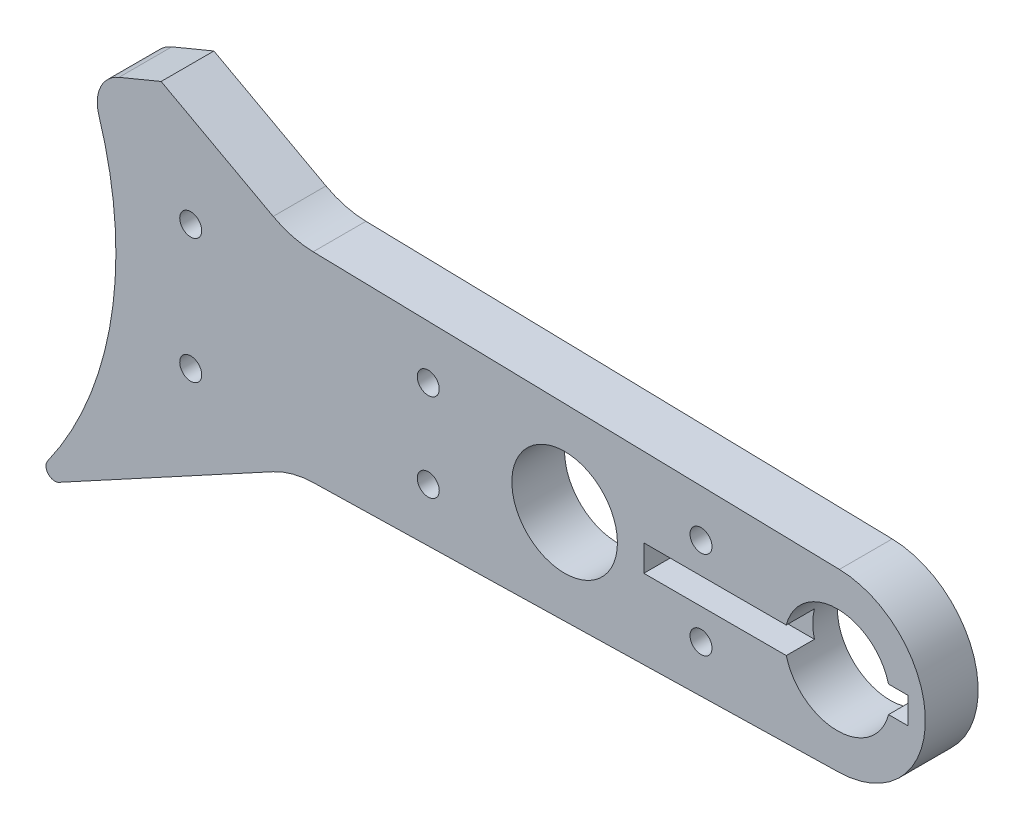
ISO-10303-21;
HEADER;
FILE_DESCRIPTION(('STEP AP214'),'2;1');
FILE_NAME('part.step','',(''),(''),'','','');
FILE_SCHEMA(('AUTOMOTIVE_DESIGN { 1 0 10303 214 1 1 1 1 }'));
ENDSEC;
DATA;
#1=APPLICATION_CONTEXT('core data for automotive mechanical design processes');
#2=APPLICATION_PROTOCOL_DEFINITION('international standard','automotive_design',2000,#1);
#3=PRODUCT_CONTEXT('',#1,'mechanical');
#4=PRODUCT('Part','Part','',(#3));
#5=PRODUCT_RELATED_PRODUCT_CATEGORY('part','',(#4));
#6=PRODUCT_DEFINITION_FORMATION('','',#4);
#7=PRODUCT_DEFINITION_CONTEXT('part definition',#1,'design');
#8=PRODUCT_DEFINITION('design','',#6,#7);
#9=PRODUCT_DEFINITION_SHAPE('','',#8);
#10=(LENGTH_UNIT() NAMED_UNIT(*) SI_UNIT(.MILLI.,.METRE.));
#11=(NAMED_UNIT(*) PLANE_ANGLE_UNIT() SI_UNIT($,.RADIAN.));
#12=(NAMED_UNIT(*) SI_UNIT($,.STERADIAN.) SOLID_ANGLE_UNIT());
#13=UNCERTAINTY_MEASURE_WITH_UNIT(LENGTH_MEASURE(1.E-05),#10,'distance_accuracy_value','');
#14=(GEOMETRIC_REPRESENTATION_CONTEXT(3) GLOBAL_UNCERTAINTY_ASSIGNED_CONTEXT((#13)) GLOBAL_UNIT_ASSIGNED_CONTEXT((#10,
#11,#12)) REPRESENTATION_CONTEXT('',''));
#15=CARTESIAN_POINT('',(0.,0.,0.));
#16=DIRECTION('',(0.,0.,1.));
#17=DIRECTION('',(1.,0.,0.));
#18=AXIS2_PLACEMENT_3D('',#15,#16,#17);
#19=CARTESIAN_POINT('',(62.,0.,3.));
#20=DIRECTION('',(0.,0.,1.));
#21=DIRECTION('',(1.,0.,0.));
#22=AXIS2_PLACEMENT_3D('',#19,#20,#21);
#23=PLANE('',#22);
#24=CARTESIAN_POINT('',(0.,0.,3.));
#25=DIRECTION('',(0.,0.,1.));
#26=DIRECTION('',(1.,0.,0.));
#27=AXIS2_PLACEMENT_3D('',#24,#25,#26);
#28=CIRCLE('',#27,21.);
#29=CARTESIAN_POINT('',(17.1198617164504,-12.161839285635,3.));
#30=VERTEX_POINT('',#29);
#31=CARTESIAN_POINT('',(20.0327066352791,6.30005276683013,3.));
#32=VERTEX_POINT('',#31);
#33=EDGE_CURVE('E241',#30,#32,#28,.T.);
#34=ORIENTED_EDGE('',*,*,#33,.F.);
#35=CARTESIAN_POINT('',(17.527477471604,-12.4514068876739,3.));
#36=DIRECTION('',(0.,0.,1.));
#37=DIRECTION('',(1.,0.,0.));
#38=AXIS2_PLACEMENT_3D('',#35,#36,#37);
#39=CIRCLE('',#38,0.5);
#40=CARTESIAN_POINT('',(17.7660568517338,-12.8908154440049,3.));
#41=VERTEX_POINT('',#40);
#42=EDGE_CURVE('E56',#30,#41,#39,.T.);
#43=ORIENTED_EDGE('',*,*,#42,.T.);
#44=DIRECTION('',(0.878817112661965,0.47715876025961,0.));
#45=VECTOR('',#44,1.);
#46=CARTESIAN_POINT('',(31.,-5.70537058296273,3.));
#47=LINE('',#46,#45);
#48=CARTESIAN_POINT('',(29.9370032673693,-6.28253071764159,3.));
#49=VERTEX_POINT('',#48);
#50=EDGE_CURVE('E405',#41,#49,#47,.T.);
#51=ORIENTED_EDGE('',*,*,#50,.T.);
#52=CARTESIAN_POINT('',(32.3227970686674,-10.6766162809514,3.));
#53=DIRECTION('',(0.,0.,1.));
#54=DIRECTION('',(1.,0.,0.));
#55=AXIS2_PLACEMENT_3D('',#52,#53,#54);
#56=CIRCLE('',#55,5.);
#57=CARTESIAN_POINT('',(32.2092648752598,-5.67790540302897,3.));
#58=VERTEX_POINT('',#57);
#59=EDGE_CURVE('E338',#49,#58,#56,.F.);
#60=ORIENTED_EDGE('',*,*,#59,.T.);
#61=DIRECTION('',(0.999742175584487,0.0227064386815126,0.));
#62=VECTOR('',#61,1.);
#63=CARTESIAN_POINT('',(18.0277563773199,-6.,3.));
#64=LINE('',#63,#62);
#65=CARTESIAN_POINT('',(62.1135321934076,-4.99871087792244,3.));
#66=VERTEX_POINT('',#65);
#67=EDGE_CURVE('E288',#58,#66,#64,.T.);
#68=ORIENTED_EDGE('',*,*,#67,.T.);
#69=CARTESIAN_POINT('',(62.,0.,3.));
#70=DIRECTION('',(0.,0.,1.));
#71=DIRECTION('',(1.,0.,0.));
#72=AXIS2_PLACEMENT_3D('',#69,#70,#71);
#73=CIRCLE('',#72,5.);
#74=CARTESIAN_POINT('',(62.1135321934076,4.99871087792244,3.));
#75=VERTEX_POINT('',#74);
#76=EDGE_CURVE('E281',#66,#75,#73,.T.);
#77=ORIENTED_EDGE('',*,*,#76,.T.);
#78=DIRECTION('',(-0.999742175584487,0.0227064386815126,0.));
#79=VECTOR('',#78,1.);
#80=CARTESIAN_POINT('',(18.0277563773199,6.,3.));
#81=LINE('',#80,#79);
#82=CARTESIAN_POINT('',(32.2092648752598,5.67790540302897,3.));
#83=VERTEX_POINT('',#82);
#84=EDGE_CURVE('E284',#75,#83,#81,.T.);
#85=ORIENTED_EDGE('',*,*,#84,.T.);
#86=CARTESIAN_POINT('',(32.3227970686674,10.6766162809514,3.));
#87=DIRECTION('',(0.,0.,1.));
#88=DIRECTION('',(1.,0.,0.));
#89=AXIS2_PLACEMENT_3D('',#86,#87,#88);
#90=CIRCLE('',#89,5.);
#91=CARTESIAN_POINT('',(29.9370032673693,6.28253071764158,3.));
#92=VERTEX_POINT('',#91);
#93=EDGE_CURVE('E334',#83,#92,#90,.F.);
#94=ORIENTED_EDGE('',*,*,#93,.T.);
#95=DIRECTION('',(-0.878817112661965,0.477158760259609,0.));
#96=VECTOR('',#95,1.);
#97=CARTESIAN_POINT('',(31.,5.70537058296273,3.));
#98=LINE('',#97,#96);
#99=CARTESIAN_POINT('',(23.5697521941608,9.73966597886913,3.));
#100=VERTEX_POINT('',#99);
#101=EDGE_CURVE('E173',#92,#100,#98,.T.);
#102=ORIENTED_EDGE('',*,*,#101,.T.);
#103=DIRECTION('',(0.923879532511286,0.382683432365091,0.));
#104=VECTOR('',#103,1.);
#105=CARTESIAN_POINT('',(22.5,9.29656011166936,3.));
#106=LINE('',#105,#104);
#107=CARTESIAN_POINT('',(21.1752165929565,8.7478168572651,3.));
#108=VERTEX_POINT('',#107);
#109=EDGE_CURVE('E184',#108,#100,#106,.T.);
#110=ORIENTED_EDGE('',*,*,#109,.F.);
#111=CARTESIAN_POINT('',(21.9405834576867,6.90005779224252,3.));
#112=DIRECTION('',(0.,0.,1.));
#113=DIRECTION('',(1.,0.,0.));
#114=AXIS2_PLACEMENT_3D('',#111,#112,#113);
#115=CIRCLE('',#114,2.);
#116=EDGE_CURVE('E322',#108,#32,#115,.T.);
#117=ORIENTED_EDGE('',*,*,#116,.T.);
#118=EDGE_LOOP('',(#34,#43,#51,#60,#68,#77,#85,#94,#102,#110,#117));
#119=FACE_BOUND('',#118,.T.);
#120=DIRECTION('',(-1.,0.,0.));
#121=VECTOR('',#120,1.);
#122=CARTESIAN_POINT('',(51.,0.75,3.));
#123=LINE('',#122,#121);
#124=CARTESIAN_POINT('',(59.0952624903444,0.75,3.));
#125=VERTEX_POINT('',#124);
#126=CARTESIAN_POINT('',(51.,0.75,3.));
#127=VERTEX_POINT('',#126);
#128=EDGE_CURVE('E215',#125,#127,#123,.T.);
#129=ORIENTED_EDGE('',*,*,#128,.F.);
#130=CARTESIAN_POINT('',(62.,0.,3.));
#131=DIRECTION('',(0.,0.,1.));
#132=DIRECTION('',(1.,0.,0.));
#133=AXIS2_PLACEMENT_3D('',#130,#131,#132);
#134=CIRCLE('',#133,3.00000000000001);
#135=CARTESIAN_POINT('',(64.9047375096556,0.75,3.));
#136=VERTEX_POINT('',#135);
#137=EDGE_CURVE('E268',#136,#125,#134,.T.);
#138=ORIENTED_EDGE('',*,*,#137,.F.);
#139=CARTESIAN_POINT('',(66.,0.75,3.));
#140=VERTEX_POINT('',#139);
#141=EDGE_CURVE('E197',#140,#136,#123,.T.);
#142=ORIENTED_EDGE('',*,*,#141,.F.);
#143=DIRECTION('',(0.,1.,0.));
#144=VECTOR('',#143,1.);
#145=CARTESIAN_POINT('',(66.,0.75,3.));
#146=LINE('',#145,#144);
#147=CARTESIAN_POINT('',(66.,-0.75,3.));
#148=VERTEX_POINT('',#147);
#149=EDGE_CURVE('E212',#148,#140,#146,.T.);
#150=ORIENTED_EDGE('',*,*,#149,.F.);
#151=DIRECTION('',(1.,0.,0.));
#152=VECTOR('',#151,1.);
#153=CARTESIAN_POINT('',(51.,-0.75,3.));
#154=LINE('',#153,#152);
#155=CARTESIAN_POINT('',(64.9047375096556,-0.75,3.));
#156=VERTEX_POINT('',#155);
#157=EDGE_CURVE('E209',#156,#148,#154,.T.);
#158=ORIENTED_EDGE('',*,*,#157,.F.);
#159=CARTESIAN_POINT('',(59.0952624903444,-0.75,3.));
#160=VERTEX_POINT('',#159);
#161=EDGE_CURVE('E272',#160,#156,#134,.T.);
#162=ORIENTED_EDGE('',*,*,#161,.F.);
#163=CARTESIAN_POINT('',(51.,-0.75,3.));
#164=VERTEX_POINT('',#163);
#165=EDGE_CURVE('E210',#164,#160,#154,.T.);
#166=ORIENTED_EDGE('',*,*,#165,.F.);
#167=DIRECTION('',(0.,-1.,0.));
#168=VECTOR('',#167,1.);
#169=CARTESIAN_POINT('',(51.,0.75,3.));
#170=LINE('',#169,#168);
#171=EDGE_CURVE('E183',#127,#164,#170,.T.);
#172=ORIENTED_EDGE('',*,*,#171,.F.);
#173=EDGE_LOOP('',(#129,#138,#142,#150,#158,#162,#166,#172));
#174=FACE_BOUND('',#173,.T.);
#175=CARTESIAN_POINT('',(25.25183575291,-3.54891407448168,3.));
#176=DIRECTION('',(0.,0.,-1.));
#177=DIRECTION('',(-1.,0.,0.));
#178=AXIS2_PLACEMENT_3D('',#175,#176,#177);
#179=CIRCLE('',#178,0.624999999999999);
#180=CARTESIAN_POINT('',(24.62683575291,-3.54891407448168,3.));
#181=VERTEX_POINT('',#180);
#182=EDGE_CURVE('E227',#181,#181,#179,.T.);
#183=ORIENTED_EDGE('',*,*,#182,.T.);
#184=EDGE_LOOP('',(#183));
#185=FACE_BOUND('',#184,.T.);
#186=CARTESIAN_POINT('',(25.25183575291,3.54891407448167,3.));
#187=DIRECTION('',(0.,0.,-1.));
#188=DIRECTION('',(-1.,0.,0.));
#189=AXIS2_PLACEMENT_3D('',#186,#187,#188);
#190=CIRCLE('',#189,0.624999999999999);
#191=CARTESIAN_POINT('',(24.62683575291,3.54891407448167,3.));
#192=VERTEX_POINT('',#191);
#193=EDGE_CURVE('E233',#192,#192,#190,.T.);
#194=ORIENTED_EDGE('',*,*,#193,.T.);
#195=EDGE_LOOP('',(#194));
#196=FACE_BOUND('',#195,.T.);
#197=CARTESIAN_POINT('',(38.75,2.5,3.));
#198=DIRECTION('',(0.,0.,1.));
#199=DIRECTION('',(1.,0.,0.));
#200=AXIS2_PLACEMENT_3D('',#197,#198,#199);
#201=CIRCLE('',#200,0.625000000000001);
#202=CARTESIAN_POINT('',(39.375,2.5,3.));
#203=VERTEX_POINT('',#202);
#204=EDGE_CURVE('E243',#203,#203,#201,.T.);
#205=ORIENTED_EDGE('',*,*,#204,.F.);
#206=EDGE_LOOP('',(#205));
#207=FACE_BOUND('',#206,.T.);
#208=CARTESIAN_POINT('',(54.25,-2.5,3.));
#209=DIRECTION('',(0.,0.,1.));
#210=DIRECTION('',(1.,0.,0.));
#211=AXIS2_PLACEMENT_3D('',#208,#209,#210);
#212=CIRCLE('',#211,0.625000000000001);
#213=CARTESIAN_POINT('',(54.875,-2.5,3.));
#214=VERTEX_POINT('',#213);
#215=EDGE_CURVE('E249',#214,#214,#212,.T.);
#216=ORIENTED_EDGE('',*,*,#215,.F.);
#217=EDGE_LOOP('',(#216));
#218=FACE_BOUND('',#217,.T.);
#219=CARTESIAN_POINT('',(38.75,-2.5,3.));
#220=DIRECTION('',(0.,0.,1.));
#221=DIRECTION('',(1.,0.,0.));
#222=AXIS2_PLACEMENT_3D('',#219,#220,#221);
#223=CIRCLE('',#222,0.625000000000001);
#224=CARTESIAN_POINT('',(39.375,-2.5,3.));
#225=VERTEX_POINT('',#224);
#226=EDGE_CURVE('E255',#225,#225,#223,.T.);
#227=ORIENTED_EDGE('',*,*,#226,.F.);
#228=EDGE_LOOP('',(#227));
#229=FACE_BOUND('',#228,.T.);
#230=CARTESIAN_POINT('',(54.25,2.5,3.));
#231=DIRECTION('',(0.,0.,1.));
#232=DIRECTION('',(1.,0.,0.));
#233=AXIS2_PLACEMENT_3D('',#230,#231,#232);
#234=CIRCLE('',#233,0.625000000000001);
#235=CARTESIAN_POINT('',(54.875,2.5,3.));
#236=VERTEX_POINT('',#235);
#237=EDGE_CURVE('E261',#236,#236,#234,.T.);
#238=ORIENTED_EDGE('',*,*,#237,.F.);
#239=EDGE_LOOP('',(#238));
#240=FACE_BOUND('',#239,.T.);
#241=CARTESIAN_POINT('',(46.5,0.,3.));
#242=DIRECTION('',(0.,0.,1.));
#243=DIRECTION('',(1.,0.,0.));
#244=AXIS2_PLACEMENT_3D('',#241,#242,#243);
#245=CIRCLE('',#244,3.);
#246=CARTESIAN_POINT('',(49.5,0.,3.));
#247=VERTEX_POINT('',#246);
#248=EDGE_CURVE('E275',#247,#247,#245,.T.);
#249=ORIENTED_EDGE('',*,*,#248,.F.);
#250=EDGE_LOOP('',(#249));
#251=FACE_BOUND('',#250,.T.);
#252=ADVANCED_FACE('F34',(#119,#174,#185,#196,#207,#218,#229,#240,#251),#23,.T.);
#253=CARTESIAN_POINT('',(62.,0.,0.));
#254=DIRECTION('',(0.,0.,1.));
#255=DIRECTION('',(1.,0.,0.));
#256=AXIS2_PLACEMENT_3D('',#253,#254,#255);
#257=PLANE('',#256);
#258=DIRECTION('',(0.878817112661965,0.47715876025961,0.));
#259=VECTOR('',#258,1.);
#260=CARTESIAN_POINT('',(31.,-5.70537058296273,0.));
#261=LINE('',#260,#259);
#262=CARTESIAN_POINT('',(17.7660568517338,-12.8908154440049,0.));
#263=VERTEX_POINT('',#262);
#264=CARTESIAN_POINT('',(29.9370032673693,-6.28253071764159,0.));
#265=VERTEX_POINT('',#264);
#266=EDGE_CURVE('E356',#263,#265,#261,.T.);
#267=ORIENTED_EDGE('',*,*,#266,.F.);
#268=CARTESIAN_POINT('',(17.527477471604,-12.4514068876739,0.));
#269=DIRECTION('',(0.,0.,1.));
#270=DIRECTION('',(1.,0.,0.));
#271=AXIS2_PLACEMENT_3D('',#268,#269,#270);
#272=CIRCLE('',#271,0.5);
#273=CARTESIAN_POINT('',(17.1198617164504,-12.161839285635,0.));
#274=VERTEX_POINT('',#273);
#275=EDGE_CURVE('E11',#263,#274,#272,.F.);
#276=ORIENTED_EDGE('',*,*,#275,.T.);
#277=CARTESIAN_POINT('',(0.,0.,0.));
#278=DIRECTION('',(0.,0.,-1.));
#279=DIRECTION('',(-1.,0.,0.));
#280=AXIS2_PLACEMENT_3D('',#277,#278,#279);
#281=CIRCLE('',#280,21.);
#282=CARTESIAN_POINT('',(20.0327066352791,6.30005276683013,0.));
#283=VERTEX_POINT('',#282);
#284=EDGE_CURVE('E236',#283,#274,#281,.T.);
#285=ORIENTED_EDGE('',*,*,#284,.F.);
#286=CARTESIAN_POINT('',(21.9405834576867,6.90005779224252,0.));
#287=DIRECTION('',(0.,0.,1.));
#288=DIRECTION('',(1.,0.,0.));
#289=AXIS2_PLACEMENT_3D('',#286,#287,#288);
#290=CIRCLE('',#289,2.);
#291=CARTESIAN_POINT('',(21.1752165929565,8.74781685726509,0.));
#292=VERTEX_POINT('',#291);
#293=EDGE_CURVE('E180',#283,#292,#290,.F.);
#294=ORIENTED_EDGE('',*,*,#293,.T.);
#295=DIRECTION('',(0.923879532511287,0.382683432365091,0.));
#296=VECTOR('',#295,1.);
#297=CARTESIAN_POINT('',(52.9285285800994,21.9004693326039,0.));
#298=LINE('',#297,#296);
#299=CARTESIAN_POINT('',(23.5697521941608,9.73966597886913,0.));
#300=VERTEX_POINT('',#299);
#301=EDGE_CURVE('E176',#292,#300,#298,.T.);
#302=ORIENTED_EDGE('',*,*,#301,.T.);
#303=DIRECTION('',(-0.878817112661965,0.477158760259609,0.));
#304=VECTOR('',#303,1.);
#305=CARTESIAN_POINT('',(31.,5.70537058296273,0.));
#306=LINE('',#305,#304);
#307=CARTESIAN_POINT('',(29.9370032673693,6.28253071764158,0.));
#308=VERTEX_POINT('',#307);
#309=EDGE_CURVE('E163',#308,#300,#306,.T.);
#310=ORIENTED_EDGE('',*,*,#309,.F.);
#311=CARTESIAN_POINT('',(32.3227970686674,10.6766162809514,0.));
#312=DIRECTION('',(0.,0.,1.));
#313=DIRECTION('',(1.,0.,0.));
#314=AXIS2_PLACEMENT_3D('',#311,#312,#313);
#315=CIRCLE('',#314,5.);
#316=CARTESIAN_POINT('',(32.2092648752598,5.67790540302897,0.));
#317=VERTEX_POINT('',#316);
#318=EDGE_CURVE('E336',#308,#317,#315,.T.);
#319=ORIENTED_EDGE('',*,*,#318,.T.);
#320=DIRECTION('',(-0.999742175584487,0.0227064386815126,0.));
#321=VECTOR('',#320,1.);
#322=CARTESIAN_POINT('',(18.0277563773199,6.,0.));
#323=LINE('',#322,#321);
#324=CARTESIAN_POINT('',(62.1135321934076,4.99871087792244,0.));
#325=VERTEX_POINT('',#324);
#326=EDGE_CURVE('E293',#325,#317,#323,.T.);
#327=ORIENTED_EDGE('',*,*,#326,.F.);
#328=CARTESIAN_POINT('',(62.,0.,0.));
#329=DIRECTION('',(0.,0.,1.));
#330=DIRECTION('',(1.,0.,0.));
#331=AXIS2_PLACEMENT_3D('',#328,#329,#330);
#332=CIRCLE('',#331,5.);
#333=CARTESIAN_POINT('',(62.1135321934076,-4.99871087792244,0.));
#334=VERTEX_POINT('',#333);
#335=EDGE_CURVE('E278',#334,#325,#332,.T.);
#336=ORIENTED_EDGE('',*,*,#335,.F.);
#337=DIRECTION('',(0.999742175584487,0.0227064386815126,0.));
#338=VECTOR('',#337,1.);
#339=CARTESIAN_POINT('',(18.0277563773199,-6.,0.));
#340=LINE('',#339,#338);
#341=CARTESIAN_POINT('',(32.2092648752598,-5.67790540302897,0.));
#342=VERTEX_POINT('',#341);
#343=EDGE_CURVE('E285',#342,#334,#340,.T.);
#344=ORIENTED_EDGE('',*,*,#343,.F.);
#345=CARTESIAN_POINT('',(32.3227970686674,-10.6766162809514,0.));
#346=DIRECTION('',(0.,0.,1.));
#347=DIRECTION('',(1.,0.,0.));
#348=AXIS2_PLACEMENT_3D('',#345,#346,#347);
#349=CIRCLE('',#348,5.);
#350=EDGE_CURVE('E340',#342,#265,#349,.T.);
#351=ORIENTED_EDGE('',*,*,#350,.T.);
#352=EDGE_LOOP('',(#267,#276,#285,#294,#302,#310,#319,#327,#336,#344,#351));
#353=FACE_BOUND('',#352,.T.);
#354=CARTESIAN_POINT('',(25.25183575291,-3.54891407448168,0.));
#355=DIRECTION('',(0.,0.,-1.));
#356=DIRECTION('',(-1.,0.,0.));
#357=AXIS2_PLACEMENT_3D('',#354,#355,#356);
#358=CIRCLE('',#357,0.624999999999999);
#359=CARTESIAN_POINT('',(24.62683575291,-3.54891407448168,0.));
#360=VERTEX_POINT('',#359);
#361=EDGE_CURVE('E220',#360,#360,#358,.T.);
#362=ORIENTED_EDGE('',*,*,#361,.F.);
#363=EDGE_LOOP('',(#362));
#364=FACE_BOUND('',#363,.T.);
#365=CARTESIAN_POINT('',(25.25183575291,3.54891407448167,0.));
#366=DIRECTION('',(0.,0.,-1.));
#367=DIRECTION('',(-1.,0.,0.));
#368=AXIS2_PLACEMENT_3D('',#365,#366,#367);
#369=CIRCLE('',#368,0.624999999999999);
#370=CARTESIAN_POINT('',(24.62683575291,3.54891407448167,0.));
#371=VERTEX_POINT('',#370);
#372=EDGE_CURVE('E230',#371,#371,#369,.T.);
#373=ORIENTED_EDGE('',*,*,#372,.F.);
#374=EDGE_LOOP('',(#373));
#375=FACE_BOUND('',#374,.T.);
#376=CARTESIAN_POINT('',(38.75,2.5,0.));
#377=DIRECTION('',(0.,0.,1.));
#378=DIRECTION('',(1.,0.,0.));
#379=AXIS2_PLACEMENT_3D('',#376,#377,#378);
#380=CIRCLE('',#379,0.625000000000001);
#381=CARTESIAN_POINT('',(39.375,2.5,0.));
#382=VERTEX_POINT('',#381);
#383=EDGE_CURVE('E246',#382,#382,#380,.T.);
#384=ORIENTED_EDGE('',*,*,#383,.T.);
#385=EDGE_LOOP('',(#384));
#386=FACE_BOUND('',#385,.T.);
#387=CARTESIAN_POINT('',(54.25,-2.5,0.));
#388=DIRECTION('',(0.,0.,1.));
#389=DIRECTION('',(1.,0.,0.));
#390=AXIS2_PLACEMENT_3D('',#387,#388,#389);
#391=CIRCLE('',#390,0.625000000000001);
#392=CARTESIAN_POINT('',(54.875,-2.5,0.));
#393=VERTEX_POINT('',#392);
#394=EDGE_CURVE('E252',#393,#393,#391,.T.);
#395=ORIENTED_EDGE('',*,*,#394,.T.);
#396=EDGE_LOOP('',(#395));
#397=FACE_BOUND('',#396,.T.);
#398=CARTESIAN_POINT('',(38.75,-2.5,0.));
#399=DIRECTION('',(0.,0.,1.));
#400=DIRECTION('',(1.,0.,0.));
#401=AXIS2_PLACEMENT_3D('',#398,#399,#400);
#402=CIRCLE('',#401,0.625000000000001);
#403=CARTESIAN_POINT('',(39.375,-2.5,0.));
#404=VERTEX_POINT('',#403);
#405=EDGE_CURVE('E258',#404,#404,#402,.T.);
#406=ORIENTED_EDGE('',*,*,#405,.T.);
#407=EDGE_LOOP('',(#406));
#408=FACE_BOUND('',#407,.T.);
#409=CARTESIAN_POINT('',(54.25,2.5,0.));
#410=DIRECTION('',(0.,0.,1.));
#411=DIRECTION('',(1.,0.,0.));
#412=AXIS2_PLACEMENT_3D('',#409,#410,#411);
#413=CIRCLE('',#412,0.625000000000001);
#414=CARTESIAN_POINT('',(54.875,2.5,0.));
#415=VERTEX_POINT('',#414);
#416=EDGE_CURVE('E264',#415,#415,#413,.T.);
#417=ORIENTED_EDGE('',*,*,#416,.T.);
#418=EDGE_LOOP('',(#417));
#419=FACE_BOUND('',#418,.T.);
#420=CARTESIAN_POINT('',(46.5,0.,0.));
#421=DIRECTION('',(0.,0.,1.));
#422=DIRECTION('',(1.,0.,0.));
#423=AXIS2_PLACEMENT_3D('',#420,#421,#422);
#424=CIRCLE('',#423,3.);
#425=CARTESIAN_POINT('',(49.5,0.,0.));
#426=VERTEX_POINT('',#425);
#427=EDGE_CURVE('E271',#426,#426,#424,.T.);
#428=ORIENTED_EDGE('',*,*,#427,.T.);
#429=EDGE_LOOP('',(#428));
#430=FACE_BOUND('',#429,.T.);
#431=CARTESIAN_POINT('',(62.,0.,0.));
#432=DIRECTION('',(0.,0.,1.));
#433=DIRECTION('',(1.,0.,0.));
#434=AXIS2_PLACEMENT_3D('',#431,#432,#433);
#435=CIRCLE('',#434,3.00000000000001);
#436=CARTESIAN_POINT('',(65.,0.,0.));
#437=VERTEX_POINT('',#436);
#438=EDGE_CURVE('E267',#437,#437,#435,.T.);
#439=ORIENTED_EDGE('',*,*,#438,.T.);
#440=EDGE_LOOP('',(#439));
#441=FACE_BOUND('',#440,.T.);
#442=ADVANCED_FACE('F177',(#353,#364,#375,#386,#397,#408,#419,#430,#441),#257,.F.);
#443=CARTESIAN_POINT('',(62.,0.,3.));
#444=DIRECTION('',(0.,0.,-1.));
#445=DIRECTION('',(-1.,0.,0.));
#446=AXIS2_PLACEMENT_3D('',#443,#444,#445);
#447=CYLINDRICAL_SURFACE('',#446,5.);
#448=ORIENTED_EDGE('',*,*,#335,.T.);
#449=DIRECTION('',(0.,0.,-1.));
#450=VECTOR('',#449,1.);
#451=CARTESIAN_POINT('',(62.1135321934076,4.99871087792244,3.));
#452=LINE('',#451,#450);
#453=EDGE_CURVE('E299',#75,#325,#452,.T.);
#454=ORIENTED_EDGE('',*,*,#453,.F.);
#455=ORIENTED_EDGE('',*,*,#76,.F.);
#456=DIRECTION('',(0.,0.,-1.));
#457=VECTOR('',#456,1.);
#458=CARTESIAN_POINT('',(62.1135321934076,-4.99871087792244,3.));
#459=LINE('',#458,#457);
#460=EDGE_CURVE('E290',#66,#334,#459,.T.);
#461=ORIENTED_EDGE('',*,*,#460,.T.);
#462=EDGE_LOOP('',(#448,#454,#455,#461));
#463=FACE_BOUND('',#462,.T.);
#464=ADVANCED_FACE('F369',(#463),#447,.T.);
#465=CARTESIAN_POINT('',(18.0277563773199,6.,3.));
#466=DIRECTION('',(-0.0227064386815126,-0.999742175584487,0.));
#467=DIRECTION('',(0.999742175584487,-0.0227064386815126,0.));
#468=AXIS2_PLACEMENT_3D('',#465,#466,#467);
#469=PLANE('',#468);
#470=ORIENTED_EDGE('',*,*,#326,.T.);
#471=DIRECTION('',(0.,0.,1.));
#472=VECTOR('',#471,1.);
#473=CARTESIAN_POINT('',(32.2092648752598,5.67790540302897,3.));
#474=LINE('',#473,#472);
#475=EDGE_CURVE('E325',#317,#83,#474,.T.);
#476=ORIENTED_EDGE('',*,*,#475,.T.);
#477=ORIENTED_EDGE('',*,*,#84,.F.);
#478=ORIENTED_EDGE('',*,*,#453,.T.);
#479=EDGE_LOOP('',(#470,#476,#477,#478));
#480=FACE_BOUND('',#479,.T.);
#481=ADVANCED_FACE('F378',(#480),#469,.F.);
#482=CARTESIAN_POINT('',(18.0277563773199,-6.,3.));
#483=DIRECTION('',(-0.0227064386815126,0.999742175584487,0.));
#484=DIRECTION('',(-0.999742175584487,-0.0227064386815126,0.));
#485=AXIS2_PLACEMENT_3D('',#482,#483,#484);
#486=PLANE('',#485);
#487=ORIENTED_EDGE('',*,*,#67,.F.);
#488=DIRECTION('',(0.,0.,1.));
#489=VECTOR('',#488,1.);
#490=CARTESIAN_POINT('',(32.2092648752598,-5.67790540302897,3.));
#491=LINE('',#490,#489);
#492=EDGE_CURVE('E332',#58,#342,#491,.F.);
#493=ORIENTED_EDGE('',*,*,#492,.T.);
#494=ORIENTED_EDGE('',*,*,#343,.T.);
#495=ORIENTED_EDGE('',*,*,#460,.F.);
#496=EDGE_LOOP('',(#487,#493,#494,#495));
#497=FACE_BOUND('',#496,.T.);
#498=ADVANCED_FACE('F375',(#497),#486,.F.);
#499=CARTESIAN_POINT('',(46.5,0.,3.));
#500=DIRECTION('',(0.,0.,-1.));
#501=DIRECTION('',(-1.,0.,0.));
#502=AXIS2_PLACEMENT_3D('',#499,#500,#501);
#503=CYLINDRICAL_SURFACE('',#502,3.);
#504=ORIENTED_EDGE('',*,*,#248,.T.);
#505=EDGE_LOOP('',(#504));
#506=FACE_BOUND('',#505,.T.);
#507=ORIENTED_EDGE('',*,*,#427,.F.);
#508=EDGE_LOOP('',(#507));
#509=FACE_BOUND('',#508,.T.);
#510=ADVANCED_FACE('F372',(#506,#509),#503,.F.);
#511=CARTESIAN_POINT('',(62.,0.,3.));
#512=DIRECTION('',(0.,0.,-1.));
#513=DIRECTION('',(-1.,0.,0.));
#514=AXIS2_PLACEMENT_3D('',#511,#512,#513);
#515=CYLINDRICAL_SURFACE('',#514,3.00000000000001);
#516=DIRECTION('',(0.,0.,-1.));
#517=VECTOR('',#516,1.);
#518=CARTESIAN_POINT('',(59.0952624903444,0.75,3.));
#519=LINE('',#518,#517);
#520=CARTESIAN_POINT('',(59.0952624903444,0.75,1.4));
#521=VERTEX_POINT('',#520);
#522=EDGE_CURVE('E314',#521,#125,#519,.F.);
#523=ORIENTED_EDGE('',*,*,#522,.F.);
#524=CARTESIAN_POINT('',(62.,0.,1.4));
#525=DIRECTION('',(0.,0.,1.));
#526=DIRECTION('',(1.,0.,0.));
#527=AXIS2_PLACEMENT_3D('',#524,#525,#526);
#528=CIRCLE('',#527,3.00000000000001);
#529=CARTESIAN_POINT('',(59.0952624903444,-0.75,1.4));
#530=VERTEX_POINT('',#529);
#531=EDGE_CURVE('E306',#521,#530,#528,.T.);
#532=ORIENTED_EDGE('',*,*,#531,.T.);
#533=DIRECTION('',(0.,0.,-1.));
#534=VECTOR('',#533,1.);
#535=CARTESIAN_POINT('',(59.0952624903444,-0.75,3.));
#536=LINE('',#535,#534);
#537=EDGE_CURVE('E311',#160,#530,#536,.T.);
#538=ORIENTED_EDGE('',*,*,#537,.F.);
#539=ORIENTED_EDGE('',*,*,#161,.T.);
#540=DIRECTION('',(0.,0.,-1.));
#541=VECTOR('',#540,1.);
#542=CARTESIAN_POINT('',(64.9047375096556,-0.75,3.));
#543=LINE('',#542,#541);
#544=CARTESIAN_POINT('',(64.9047375096556,-0.75,1.4));
#545=VERTEX_POINT('',#544);
#546=EDGE_CURVE('E305',#545,#156,#543,.F.);
#547=ORIENTED_EDGE('',*,*,#546,.F.);
#548=CARTESIAN_POINT('',(64.9047375096556,0.75,1.4));
#549=VERTEX_POINT('',#548);
#550=EDGE_CURVE('E302',#545,#549,#528,.T.);
#551=ORIENTED_EDGE('',*,*,#550,.T.);
#552=DIRECTION('',(0.,0.,-1.));
#553=VECTOR('',#552,1.);
#554=CARTESIAN_POINT('',(64.9047375096556,0.75,3.));
#555=LINE('',#554,#553);
#556=EDGE_CURVE('E308',#136,#549,#555,.T.);
#557=ORIENTED_EDGE('',*,*,#556,.F.);
#558=ORIENTED_EDGE('',*,*,#137,.T.);
#559=EDGE_LOOP('',(#523,#532,#538,#539,#547,#551,#557,#558));
#560=FACE_BOUND('',#559,.T.);
#561=ORIENTED_EDGE('',*,*,#438,.F.);
#562=EDGE_LOOP('',(#561));
#563=FACE_BOUND('',#562,.T.);
#564=ADVANCED_FACE('F463',(#560,#563),#515,.F.);
#565=CARTESIAN_POINT('',(54.25,2.5,3.));
#566=DIRECTION('',(0.,0.,1.));
#567=DIRECTION('',(1.,0.,0.));
#568=AXIS2_PLACEMENT_3D('',#565,#566,#567);
#569=CYLINDRICAL_SURFACE('',#568,0.625000000000001);
#570=ORIENTED_EDGE('',*,*,#416,.F.);
#571=EDGE_LOOP('',(#570));
#572=FACE_BOUND('',#571,.T.);
#573=ORIENTED_EDGE('',*,*,#237,.T.);
#574=EDGE_LOOP('',(#573));
#575=FACE_BOUND('',#574,.T.);
#576=ADVANCED_FACE('F460',(#572,#575),#569,.F.);
#577=CARTESIAN_POINT('',(38.75,-2.5,3.));
#578=DIRECTION('',(0.,0.,1.));
#579=DIRECTION('',(1.,0.,0.));
#580=AXIS2_PLACEMENT_3D('',#577,#578,#579);
#581=CYLINDRICAL_SURFACE('',#580,0.625000000000001);
#582=ORIENTED_EDGE('',*,*,#405,.F.);
#583=EDGE_LOOP('',(#582));
#584=FACE_BOUND('',#583,.T.);
#585=ORIENTED_EDGE('',*,*,#226,.T.);
#586=EDGE_LOOP('',(#585));
#587=FACE_BOUND('',#586,.T.);
#588=ADVANCED_FACE('F456',(#584,#587),#581,.F.);
#589=CARTESIAN_POINT('',(54.25,-2.5,3.));
#590=DIRECTION('',(0.,0.,1.));
#591=DIRECTION('',(1.,0.,0.));
#592=AXIS2_PLACEMENT_3D('',#589,#590,#591);
#593=CYLINDRICAL_SURFACE('',#592,0.625000000000001);
#594=ORIENTED_EDGE('',*,*,#394,.F.);
#595=EDGE_LOOP('',(#594));
#596=FACE_BOUND('',#595,.T.);
#597=ORIENTED_EDGE('',*,*,#215,.T.);
#598=EDGE_LOOP('',(#597));
#599=FACE_BOUND('',#598,.T.);
#600=ADVANCED_FACE('F452',(#596,#599),#593,.F.);
#601=CARTESIAN_POINT('',(38.75,2.5,3.));
#602=DIRECTION('',(0.,0.,1.));
#603=DIRECTION('',(1.,0.,0.));
#604=AXIS2_PLACEMENT_3D('',#601,#602,#603);
#605=CYLINDRICAL_SURFACE('',#604,0.625000000000001);
#606=ORIENTED_EDGE('',*,*,#383,.F.);
#607=EDGE_LOOP('',(#606));
#608=FACE_BOUND('',#607,.T.);
#609=ORIENTED_EDGE('',*,*,#204,.T.);
#610=EDGE_LOOP('',(#609));
#611=FACE_BOUND('',#610,.T.);
#612=ADVANCED_FACE('F449',(#608,#611),#605,.F.);
#613=CARTESIAN_POINT('',(0.,0.,10.));
#614=DIRECTION('',(0.,0.,-1.));
#615=DIRECTION('',(-1.,0.,0.));
#616=AXIS2_PLACEMENT_3D('',#613,#614,#615);
#617=CYLINDRICAL_SURFACE('',#616,21.);
#618=ORIENTED_EDGE('',*,*,#284,.T.);
#619=DIRECTION('',(0.,0.,-1.));
#620=VECTOR('',#619,1.);
#621=CARTESIAN_POINT('',(17.1198617164504,-12.161839285635,10.));
#622=LINE('',#621,#620);
#623=EDGE_CURVE('E343',#274,#30,#622,.F.);
#624=ORIENTED_EDGE('',*,*,#623,.T.);
#625=ORIENTED_EDGE('',*,*,#33,.T.);
#626=DIRECTION('',(0.,0.,-1.));
#627=VECTOR('',#626,1.);
#628=CARTESIAN_POINT('',(20.0327066352791,6.30005276683013,10.));
#629=LINE('',#628,#627);
#630=EDGE_CURVE('E316',#32,#283,#629,.T.);
#631=ORIENTED_EDGE('',*,*,#630,.T.);
#632=EDGE_LOOP('',(#618,#624,#625,#631));
#633=FACE_BOUND('',#632,.T.);
#634=ADVANCED_FACE('F348',(#633),#617,.F.);
#635=CARTESIAN_POINT('',(25.25183575291,3.54891407448167,3.));
#636=DIRECTION('',(0.,0.,-1.));
#637=DIRECTION('',(-1.,0.,0.));
#638=AXIS2_PLACEMENT_3D('',#635,#636,#637);
#639=CYLINDRICAL_SURFACE('',#638,0.624999999999999);
#640=ORIENTED_EDGE('',*,*,#193,.F.);
#641=EDGE_LOOP('',(#640));
#642=FACE_BOUND('',#641,.T.);
#643=ORIENTED_EDGE('',*,*,#372,.T.);
#644=EDGE_LOOP('',(#643));
#645=FACE_BOUND('',#644,.T.);
#646=ADVANCED_FACE('F442',(#642,#645),#639,.F.);
#647=CARTESIAN_POINT('',(25.25183575291,-3.54891407448168,3.));
#648=DIRECTION('',(0.,0.,-1.));
#649=DIRECTION('',(-1.,0.,0.));
#650=AXIS2_PLACEMENT_3D('',#647,#648,#649);
#651=CYLINDRICAL_SURFACE('',#650,0.624999999999999);
#652=ORIENTED_EDGE('',*,*,#182,.F.);
#653=EDGE_LOOP('',(#652));
#654=FACE_BOUND('',#653,.T.);
#655=ORIENTED_EDGE('',*,*,#361,.T.);
#656=EDGE_LOOP('',(#655));
#657=FACE_BOUND('',#656,.T.);
#658=ADVANCED_FACE('F421',(#654,#657),#651,.F.);
#659=CARTESIAN_POINT('',(0.,0.,1.4));
#660=DIRECTION('',(0.,0.,1.));
#661=DIRECTION('',(1.,0.,0.));
#662=AXIS2_PLACEMENT_3D('',#659,#660,#661);
#663=PLANE('',#662);
#664=DIRECTION('',(1.,0.,0.));
#665=VECTOR('',#664,1.);
#666=CARTESIAN_POINT('',(51.,-0.75,1.4));
#667=LINE('',#666,#665);
#668=CARTESIAN_POINT('',(66.,-0.75,1.4));
#669=VERTEX_POINT('',#668);
#670=EDGE_CURVE('E196',#545,#669,#667,.T.);
#671=ORIENTED_EDGE('',*,*,#670,.T.);
#672=DIRECTION('',(0.,1.,0.));
#673=VECTOR('',#672,1.);
#674=CARTESIAN_POINT('',(66.,0.75,1.4));
#675=LINE('',#674,#673);
#676=CARTESIAN_POINT('',(66.,0.75,1.4));
#677=VERTEX_POINT('',#676);
#678=EDGE_CURVE('E200',#669,#677,#675,.T.);
#679=ORIENTED_EDGE('',*,*,#678,.T.);
#680=DIRECTION('',(-1.,0.,0.));
#681=VECTOR('',#680,1.);
#682=CARTESIAN_POINT('',(51.,0.75,1.4));
#683=LINE('',#682,#681);
#684=EDGE_CURVE('E204',#677,#549,#683,.T.);
#685=ORIENTED_EDGE('',*,*,#684,.T.);
#686=ORIENTED_EDGE('',*,*,#550,.F.);
#687=EDGE_LOOP('',(#671,#679,#685,#686));
#688=FACE_BOUND('',#687,.T.);
#689=ADVANCED_FACE('F417',(#688),#663,.T.);
#690=CARTESIAN_POINT('',(51.,-0.75,1.4));
#691=DIRECTION('',(0.,-1.,0.));
#692=DIRECTION('',(0.,0.,-1.));
#693=AXIS2_PLACEMENT_3D('',#690,#691,#692);
#694=PLANE('',#693);
#695=ORIENTED_EDGE('',*,*,#546,.T.);
#696=ORIENTED_EDGE('',*,*,#157,.T.);
#697=DIRECTION('',(0.,0.,1.));
#698=VECTOR('',#697,1.);
#699=CARTESIAN_POINT('',(66.,-0.75,1.4));
#700=LINE('',#699,#698);
#701=EDGE_CURVE('E223',#669,#148,#700,.T.);
#702=ORIENTED_EDGE('',*,*,#701,.F.);
#703=ORIENTED_EDGE('',*,*,#670,.F.);
#704=EDGE_LOOP('',(#695,#696,#702,#703));
#705=FACE_BOUND('',#704,.T.);
#706=ADVANCED_FACE('F420',(#705),#694,.F.);
#707=CARTESIAN_POINT('',(51.,0.75,1.4));
#708=DIRECTION('',(0.,1.,0.));
#709=DIRECTION('',(0.,0.,1.));
#710=AXIS2_PLACEMENT_3D('',#707,#708,#709);
#711=PLANE('',#710);
#712=ORIENTED_EDGE('',*,*,#556,.T.);
#713=ORIENTED_EDGE('',*,*,#684,.F.);
#714=DIRECTION('',(0.,0.,1.));
#715=VECTOR('',#714,1.);
#716=CARTESIAN_POINT('',(66.,0.75,1.4));
#717=LINE('',#716,#715);
#718=EDGE_CURVE('E221',#677,#140,#717,.T.);
#719=ORIENTED_EDGE('',*,*,#718,.T.);
#720=ORIENTED_EDGE('',*,*,#141,.T.);
#721=EDGE_LOOP('',(#712,#713,#719,#720));
#722=FACE_BOUND('',#721,.T.);
#723=ADVANCED_FACE('F428',(#722),#711,.F.);
#724=CARTESIAN_POINT('',(66.,0.75,1.4));
#725=DIRECTION('',(1.,0.,0.));
#726=DIRECTION('',(0.,0.,-1.));
#727=AXIS2_PLACEMENT_3D('',#724,#725,#726);
#728=PLANE('',#727);
#729=ORIENTED_EDGE('',*,*,#149,.T.);
#730=ORIENTED_EDGE('',*,*,#718,.F.);
#731=ORIENTED_EDGE('',*,*,#678,.F.);
#732=ORIENTED_EDGE('',*,*,#701,.T.);
#733=EDGE_LOOP('',(#729,#730,#731,#732));
#734=FACE_BOUND('',#733,.T.);
#735=ADVANCED_FACE('F429',(#734),#728,.F.);
#736=ORIENTED_EDGE('',*,*,#537,.T.);
#737=CARTESIAN_POINT('',(51.,-0.75,1.4));
#738=VERTEX_POINT('',#737);
#739=EDGE_CURVE('E198',#738,#530,#667,.T.);
#740=ORIENTED_EDGE('',*,*,#739,.F.);
#741=DIRECTION('',(0.,0.,1.));
#742=VECTOR('',#741,1.);
#743=CARTESIAN_POINT('',(51.,-0.75,1.4));
#744=LINE('',#743,#742);
#745=EDGE_CURVE('E206',#738,#164,#744,.T.);
#746=ORIENTED_EDGE('',*,*,#745,.T.);
#747=ORIENTED_EDGE('',*,*,#165,.T.);
#748=EDGE_LOOP('',(#736,#740,#746,#747));
#749=FACE_BOUND('',#748,.T.);
#750=ADVANCED_FACE('F432',(#749),#694,.F.);
#751=CARTESIAN_POINT('',(51.,0.75,1.4));
#752=VERTEX_POINT('',#751);
#753=EDGE_CURVE('E203',#521,#752,#683,.T.);
#754=ORIENTED_EDGE('',*,*,#753,.T.);
#755=DIRECTION('',(0.,-1.,0.));
#756=VECTOR('',#755,1.);
#757=CARTESIAN_POINT('',(51.,0.75,1.4));
#758=LINE('',#757,#756);
#759=EDGE_CURVE('E193',#752,#738,#758,.T.);
#760=ORIENTED_EDGE('',*,*,#759,.T.);
#761=ORIENTED_EDGE('',*,*,#739,.T.);
#762=ORIENTED_EDGE('',*,*,#531,.F.);
#763=EDGE_LOOP('',(#754,#760,#761,#762));
#764=FACE_BOUND('',#763,.T.);
#765=ADVANCED_FACE('F423',(#764),#663,.T.);
#766=CARTESIAN_POINT('',(51.,0.75,1.4));
#767=DIRECTION('',(-1.,0.,0.));
#768=DIRECTION('',(0.,0.,1.));
#769=AXIS2_PLACEMENT_3D('',#766,#767,#768);
#770=PLANE('',#769);
#771=ORIENTED_EDGE('',*,*,#171,.T.);
#772=ORIENTED_EDGE('',*,*,#745,.F.);
#773=ORIENTED_EDGE('',*,*,#759,.F.);
#774=DIRECTION('',(0.,0.,1.));
#775=VECTOR('',#774,1.);
#776=CARTESIAN_POINT('',(51.,0.75,1.4));
#777=LINE('',#776,#775);
#778=EDGE_CURVE('E217',#752,#127,#777,.T.);
#779=ORIENTED_EDGE('',*,*,#778,.T.);
#780=EDGE_LOOP('',(#771,#772,#773,#779));
#781=FACE_BOUND('',#780,.T.);
#782=ADVANCED_FACE('F426',(#781),#770,.F.);
#783=ORIENTED_EDGE('',*,*,#522,.T.);
#784=ORIENTED_EDGE('',*,*,#128,.T.);
#785=ORIENTED_EDGE('',*,*,#778,.F.);
#786=ORIENTED_EDGE('',*,*,#753,.F.);
#787=EDGE_LOOP('',(#783,#784,#785,#786));
#788=FACE_BOUND('',#787,.T.);
#789=ADVANCED_FACE('F416',(#788),#711,.F.);
#790=CARTESIAN_POINT('',(22.5,9.29656011166936,-7.));
#791=DIRECTION('',(0.382683432365091,-0.923879532511287,0.));
#792=DIRECTION('',(0.923879532511287,0.382683432365091,0.));
#793=AXIS2_PLACEMENT_3D('',#790,#791,#792);
#794=PLANE('',#793);
#795=ORIENTED_EDGE('',*,*,#301,.F.);
#796=DIRECTION('',(0.,0.,-1.));
#797=VECTOR('',#796,1.);
#798=CARTESIAN_POINT('',(21.1752165929565,8.7478168572651,-7.));
#799=LINE('',#798,#797);
#800=EDGE_CURVE('E320',#292,#108,#799,.F.);
#801=ORIENTED_EDGE('',*,*,#800,.T.);
#802=ORIENTED_EDGE('',*,*,#109,.T.);
#803=DIRECTION('',(0.,0.,1.));
#804=VECTOR('',#803,1.);
#805=CARTESIAN_POINT('',(23.5697521941608,9.73966597886913,0.));
#806=LINE('',#805,#804);
#807=EDGE_CURVE('E168',#300,#100,#806,.T.);
#808=ORIENTED_EDGE('',*,*,#807,.F.);
#809=EDGE_LOOP('',(#795,#801,#802,#808));
#810=FACE_BOUND('',#809,.T.);
#811=ADVANCED_FACE('F187',(#810),#794,.F.);
#812=CARTESIAN_POINT('',(21.9405834576867,6.90005779224252,10.));
#813=DIRECTION('',(0.,0.,-1.));
#814=DIRECTION('',(-1.,0.,0.));
#815=AXIS2_PLACEMENT_3D('',#812,#813,#814);
#816=CYLINDRICAL_SURFACE('',#815,2.);
#817=ORIENTED_EDGE('',*,*,#116,.F.);
#818=ORIENTED_EDGE('',*,*,#800,.F.);
#819=ORIENTED_EDGE('',*,*,#293,.F.);
#820=ORIENTED_EDGE('',*,*,#630,.F.);
#821=EDGE_LOOP('',(#817,#818,#819,#820));
#822=FACE_BOUND('',#821,.T.);
#823=ADVANCED_FACE('F355',(#822),#816,.T.);
#824=CARTESIAN_POINT('',(31.,5.70537058296273,0.));
#825=DIRECTION('',(0.477158760259609,0.878817112661965,0.));
#826=DIRECTION('',(-0.878817112661965,0.477158760259609,0.));
#827=AXIS2_PLACEMENT_3D('',#824,#825,#826);
#828=PLANE('',#827);
#829=ORIENTED_EDGE('',*,*,#101,.F.);
#830=DIRECTION('',(0.,0.,1.));
#831=VECTOR('',#830,1.);
#832=CARTESIAN_POINT('',(29.9370032673693,6.28253071764158,0.));
#833=LINE('',#832,#831);
#834=EDGE_CURVE('E170',#92,#308,#833,.F.);
#835=ORIENTED_EDGE('',*,*,#834,.T.);
#836=ORIENTED_EDGE('',*,*,#309,.T.);
#837=ORIENTED_EDGE('',*,*,#807,.T.);
#838=EDGE_LOOP('',(#829,#835,#836,#837));
#839=FACE_BOUND('',#838,.T.);
#840=ADVANCED_FACE('F166',(#839),#828,.T.);
#841=CARTESIAN_POINT('',(31.,-5.70537058296273,0.));
#842=DIRECTION('',(0.47715876025961,-0.878817112661964,0.));
#843=DIRECTION('',(0.878817112661965,0.47715876025961,0.));
#844=AXIS2_PLACEMENT_3D('',#841,#842,#843);
#845=PLANE('',#844);
#846=ORIENTED_EDGE('',*,*,#50,.F.);
#847=DIRECTION('',(0.,0.,1.));
#848=VECTOR('',#847,1.);
#849=CARTESIAN_POINT('',(17.7660568517338,-12.8908154440049,0.));
#850=LINE('',#849,#848);
#851=EDGE_CURVE('E42',#41,#263,#850,.F.);
#852=ORIENTED_EDGE('',*,*,#851,.T.);
#853=ORIENTED_EDGE('',*,*,#266,.T.);
#854=DIRECTION('',(0.,0.,1.));
#855=VECTOR('',#854,1.);
#856=CARTESIAN_POINT('',(29.9370032673693,-6.28253071764159,0.));
#857=LINE('',#856,#855);
#858=EDGE_CURVE('E329',#265,#49,#857,.T.);
#859=ORIENTED_EDGE('',*,*,#858,.T.);
#860=EDGE_LOOP('',(#846,#852,#853,#859));
#861=FACE_BOUND('',#860,.T.);
#862=ADVANCED_FACE('F389',(#861),#845,.T.);
#863=CARTESIAN_POINT('',(32.3227970686674,10.6766162809514,3.));
#864=DIRECTION('',(0.,0.,1.));
#865=DIRECTION('',(1.,0.,0.));
#866=AXIS2_PLACEMENT_3D('',#863,#864,#865);
#867=CYLINDRICAL_SURFACE('',#866,5.);
#868=ORIENTED_EDGE('',*,*,#318,.F.);
#869=ORIENTED_EDGE('',*,*,#834,.F.);
#870=ORIENTED_EDGE('',*,*,#93,.F.);
#871=ORIENTED_EDGE('',*,*,#475,.F.);
#872=EDGE_LOOP('',(#868,#869,#870,#871));
#873=FACE_BOUND('',#872,.T.);
#874=ADVANCED_FACE('F362',(#873),#867,.F.);
#875=CARTESIAN_POINT('',(32.3227970686674,-10.6766162809514,0.));
#876=DIRECTION('',(0.,0.,1.));
#877=DIRECTION('',(1.,0.,0.));
#878=AXIS2_PLACEMENT_3D('',#875,#876,#877);
#879=CYLINDRICAL_SURFACE('',#878,5.);
#880=ORIENTED_EDGE('',*,*,#350,.F.);
#881=ORIENTED_EDGE('',*,*,#492,.F.);
#882=ORIENTED_EDGE('',*,*,#59,.F.);
#883=ORIENTED_EDGE('',*,*,#858,.F.);
#884=EDGE_LOOP('',(#880,#881,#882,#883));
#885=FACE_BOUND('',#884,.T.);
#886=ADVANCED_FACE('F358',(#885),#879,.F.);
#887=CARTESIAN_POINT('',(17.527477471604,-12.4514068876739,10.));
#888=DIRECTION('',(0.,0.,-1.));
#889=DIRECTION('',(-1.,0.,0.));
#890=AXIS2_PLACEMENT_3D('',#887,#888,#889);
#891=CYLINDRICAL_SURFACE('',#890,0.5);
#892=ORIENTED_EDGE('',*,*,#275,.F.);
#893=ORIENTED_EDGE('',*,*,#851,.F.);
#894=ORIENTED_EDGE('',*,*,#42,.F.);
#895=ORIENTED_EDGE('',*,*,#623,.F.);
#896=EDGE_LOOP('',(#892,#893,#894,#895));
#897=FACE_BOUND('',#896,.T.);
#898=ADVANCED_FACE('F36',(#897),#891,.T.);
#899=CLOSED_SHELL('',(#252,#442,#464,#481,#498,#510,#564,#576,#588,#600,#612,#634,#646,#658,
#689,#706,#723,#735,#750,#765,#782,#789,#811,#823,#840,#862,#874,#886,#898));
#900=MANIFOLD_SOLID_BREP('B2',#899);
#901=ADVANCED_BREP_SHAPE_REPRESENTATION('',(#18,#900),#14);
#902=SHAPE_DEFINITION_REPRESENTATION(#9,#901);
ENDSEC;
END-ISO-10303-21;
